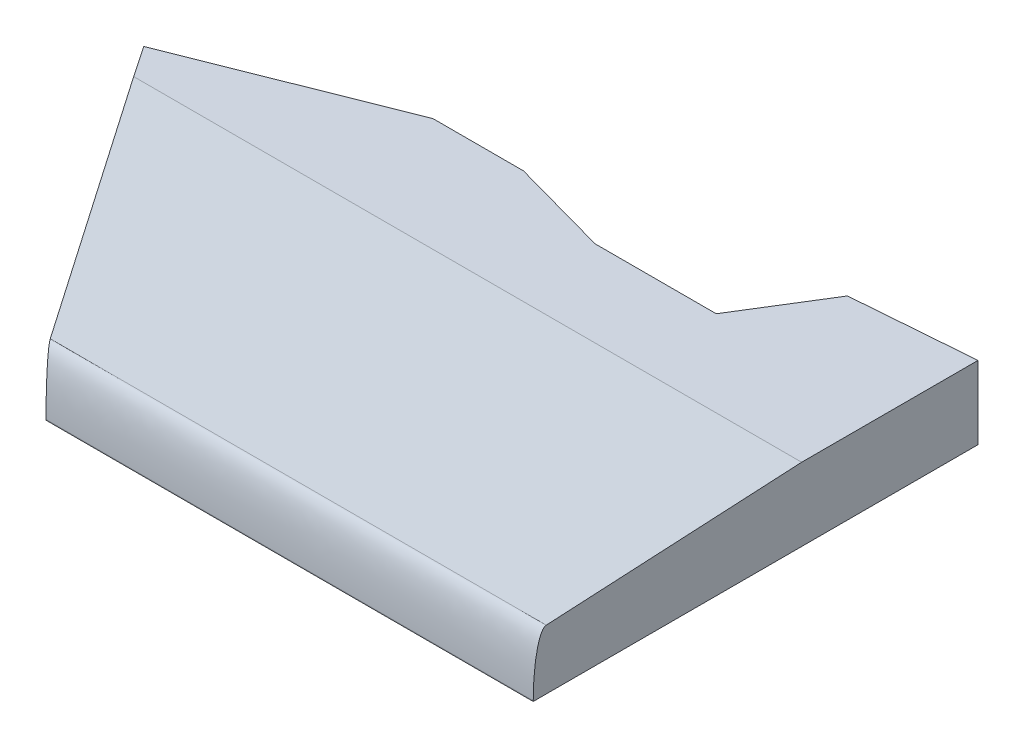
ISO-10303-21;
HEADER;
FILE_DESCRIPTION(('STEP AP214'),'2;1');
FILE_NAME('part.step','',(''),(''),'','','');
FILE_SCHEMA(('AUTOMOTIVE_DESIGN { 1 0 10303 214 1 1 1 1 }'));
ENDSEC;
DATA;
#1=APPLICATION_CONTEXT('core data for automotive mechanical design processes');
#2=APPLICATION_PROTOCOL_DEFINITION('international standard','automotive_design',2000,#1);
#3=PRODUCT_CONTEXT('',#1,'mechanical');
#4=PRODUCT('Part','Part','',(#3));
#5=PRODUCT_RELATED_PRODUCT_CATEGORY('part','',(#4));
#6=PRODUCT_DEFINITION_FORMATION('','',#4);
#7=PRODUCT_DEFINITION_CONTEXT('part definition',#1,'design');
#8=PRODUCT_DEFINITION('design','',#6,#7);
#9=PRODUCT_DEFINITION_SHAPE('','',#8);
#10=(LENGTH_UNIT() NAMED_UNIT(*) SI_UNIT(.MILLI.,.METRE.));
#11=(NAMED_UNIT(*) PLANE_ANGLE_UNIT() SI_UNIT($,.RADIAN.));
#12=(NAMED_UNIT(*) SI_UNIT($,.STERADIAN.) SOLID_ANGLE_UNIT());
#13=UNCERTAINTY_MEASURE_WITH_UNIT(LENGTH_MEASURE(1.E-05),#10,'distance_accuracy_value','');
#14=(GEOMETRIC_REPRESENTATION_CONTEXT(3) GLOBAL_UNCERTAINTY_ASSIGNED_CONTEXT((#13)) GLOBAL_UNIT_ASSIGNED_CONTEXT((#10,
#11,#12)) REPRESENTATION_CONTEXT('',''));
#15=CARTESIAN_POINT('',(0.,0.,0.));
#16=DIRECTION('',(0.,0.,1.));
#17=DIRECTION('',(1.,0.,0.));
#18=AXIS2_PLACEMENT_3D('',#15,#16,#17);
#19=CARTESIAN_POINT('',(6.77357097779002,13.6,17.0708441657719));
#20=DIRECTION('',(-0.36881854007509,0.,-0.929501417157004));
#21=DIRECTION('',(-0.929501417157004,0.,0.36881854007509));
#22=AXIS2_PLACEMENT_3D('',#19,#20,#21);
#23=PLANE('',#22);
#24=DIRECTION('',(0.929501417157004,0.,-0.36881854007509));
#25=VECTOR('',#24,1.);
#26=CARTESIAN_POINT('',(6.77357097779002,0.,17.0708441657719));
#27=LINE('',#26,#25);
#28=CARTESIAN_POINT('',(37.6537953880634,0.,4.8178243489507));
#29=VERTEX_POINT('',#28);
#30=CARTESIAN_POINT('',(76.2078524693681,0.,-10.4801093434911));
#31=VERTEX_POINT('',#30);
#32=EDGE_CURVE('E138',#29,#31,#27,.T.);
#33=ORIENTED_EDGE('',*,*,#32,.F.);
#34=DIRECTION('',(0.,-1.,0.));
#35=VECTOR('',#34,1.);
#36=CARTESIAN_POINT('',(37.6537953880634,13.6,4.8178243489507));
#37=LINE('',#36,#35);
#38=CARTESIAN_POINT('',(37.6537953880634,13.6,4.8178243489507));
#39=VERTEX_POINT('',#38);
#40=EDGE_CURVE('E141',#39,#29,#37,.T.);
#41=ORIENTED_EDGE('',*,*,#40,.F.);
#42=DIRECTION('',(0.929501417157004,0.,-0.36881854007509));
#43=VECTOR('',#42,1.);
#44=CARTESIAN_POINT('',(6.77357097779002,13.6,17.0708441657719));
#45=LINE('',#44,#43);
#46=CARTESIAN_POINT('',(76.2078524693681,13.6,-10.4801093434911));
#47=VERTEX_POINT('',#46);
#48=EDGE_CURVE('E328',#39,#47,#45,.T.);
#49=ORIENTED_EDGE('',*,*,#48,.T.);
#50=DIRECTION('',(0.,-1.,0.));
#51=VECTOR('',#50,1.);
#52=CARTESIAN_POINT('',(76.2078524693681,13.6,-10.4801093434911));
#53=LINE('',#52,#51);
#54=EDGE_CURVE('E143',#47,#31,#53,.T.);
#55=ORIENTED_EDGE('',*,*,#54,.T.);
#56=EDGE_LOOP('',(#33,#41,#49,#55));
#57=FACE_BOUND('',#56,.T.);
#58=ADVANCED_FACE('F48',(#57),#23,.T.);
#59=CARTESIAN_POINT('',(165.988080985326,13.6,0.));
#60=DIRECTION('',(1.,0.,0.));
#61=DIRECTION('',(0.,0.,-1.));
#62=AXIS2_PLACEMENT_3D('',#59,#60,#61);
#63=PLANE('',#62);
#64=DIRECTION('',(0.,0.0523359562429405,-0.998629534754574));
#65=VECTOR('',#64,1.);
#66=CARTESIAN_POINT('',(165.988080985326,14.15494890973,0.0290836399744901));
#67=LINE('',#66,#65);
#68=CARTESIAN_POINT('',(165.988080985326,13.6,10.6181396412382));
#69=VERTEX_POINT('',#68);
#70=CARTESIAN_POINT('',(165.988080985326,11.1066634500202,58.1938351599139));
#71=VERTEX_POINT('',#70);
#72=EDGE_CURVE('E216',#69,#71,#67,.F.);
#73=ORIENTED_EDGE('',*,*,#72,.T.);
#74=CARTESIAN_POINT('',(165.988080985326,0.121738567719923,60.6181396412415));
#75=CARTESIAN_POINT('',(165.988080985326,10.9796110358479,60.6181396412415));
#76=CARTESIAN_POINT('',(165.988080985326,11.1066634500202,58.1938351599139));
#77=(BOUNDED_CURVE() B_SPLINE_CURVE(2,(#74,#75,#76),.UNSPECIFIED.,.F.,
.F.) B_SPLINE_CURVE_WITH_KNOTS((3,3),(0.,1.),
.UNSPECIFIED.) CURVE() GEOMETRIC_REPRESENTATION_ITEM() RATIONAL_B_SPLINE_CURVE((1.,
0.725374371012286,1.)) REPRESENTATION_ITEM(''));
#78=CARTESIAN_POINT('',(165.988080985326,0.121738567719923,60.6181396412415));
#79=VERTEX_POINT('',#78);
#80=EDGE_CURVE('E12',#71,#79,#77,.F.);
#81=ORIENTED_EDGE('',*,*,#80,.T.);
#82=DIRECTION('',(0.,-1.,0.));
#83=VECTOR('',#82,1.);
#84=CARTESIAN_POINT('',(165.988080985326,13.6,60.6181396412415));
#85=LINE('',#84,#83);
#86=CARTESIAN_POINT('',(165.988080985326,0.,60.6181396412415));
#87=VERTEX_POINT('',#86);
#88=EDGE_CURVE('E177',#79,#87,#85,.T.);
#89=ORIENTED_EDGE('',*,*,#88,.T.);
#90=DIRECTION('',(0.,0.,1.));
#91=VECTOR('',#90,1.);
#92=CARTESIAN_POINT('',(165.988080985326,0.,0.));
#93=LINE('',#92,#91);
#94=CARTESIAN_POINT('',(165.988080985326,0.,-22.2356790575523));
#95=VERTEX_POINT('',#94);
#96=EDGE_CURVE('E148',#95,#87,#93,.T.);
#97=ORIENTED_EDGE('',*,*,#96,.F.);
#98=DIRECTION('',(0.,-1.,0.));
#99=VECTOR('',#98,1.);
#100=CARTESIAN_POINT('',(165.988080985326,13.6,-22.2356790575523));
#101=LINE('',#100,#99);
#102=CARTESIAN_POINT('',(165.988080985326,13.6,-22.2356790575523));
#103=VERTEX_POINT('',#102);
#104=EDGE_CURVE('E158',#103,#95,#101,.T.);
#105=ORIENTED_EDGE('',*,*,#104,.F.);
#106=DIRECTION('',(0.,0.,1.));
#107=VECTOR('',#106,1.);
#108=CARTESIAN_POINT('',(165.988080985326,13.6,0.));
#109=LINE('',#108,#107);
#110=EDGE_CURVE('E331',#103,#69,#109,.T.);
#111=ORIENTED_EDGE('',*,*,#110,.T.);
#112=EDGE_LOOP('',(#73,#81,#89,#97,#105,#111));
#113=FACE_BOUND('',#112,.T.);
#114=ADVANCED_FACE('F241',(#113),#63,.T.);
#115=CARTESIAN_POINT('',(-0.719959146505458,13.6,-9.22485841457915));
#116=DIRECTION('',(-0.0778089382117249,0.,-0.99696828893118));
#117=DIRECTION('',(-0.99696828893118,0.,0.0778089382117249));
#118=AXIS2_PLACEMENT_3D('',#115,#116,#117);
#119=PLANE('',#118);
#120=CARTESIAN_POINT('',(154.709225146618,6.8,-21.3554145528569));
#121=DIRECTION('',(-0.0778089382117249,0.,-0.99696828893118));
#122=DIRECTION('',(-0.99696828893118,0.,0.0778089382117249));
#123=AXIS2_PLACEMENT_3D('',#120,#121,#122);
#124=CIRCLE('',#123,1.59999999999999);
#125=CARTESIAN_POINT('',(153.114075884328,6.8,-21.2309202517182));
#126=VERTEX_POINT('',#125);
#127=EDGE_CURVE('E168',#126,#126,#124,.T.);
#128=ORIENTED_EDGE('',*,*,#127,.F.);
#129=EDGE_LOOP('',(#128));
#130=FACE_BOUND('',#129,.T.);
#131=DIRECTION('',(0.99696828893118,0.,-0.0778089382117249));
#132=VECTOR('',#131,1.);
#133=CARTESIAN_POINT('',(-0.719959146505458,0.,-9.22485841457915));
#134=LINE('',#133,#132);
#135=CARTESIAN_POINT('',(143.430369307909,0.,-20.4751500481616));
#136=VERTEX_POINT('',#135);
#137=EDGE_CURVE('E369',#136,#95,#134,.T.);
#138=ORIENTED_EDGE('',*,*,#137,.F.);
#139=DIRECTION('',(0.,-1.,0.));
#140=VECTOR('',#139,1.);
#141=CARTESIAN_POINT('',(143.430369307909,13.6,-20.4751500481616));
#142=LINE('',#141,#140);
#143=CARTESIAN_POINT('',(143.430369307909,13.6,-20.4751500481616));
#144=VERTEX_POINT('',#143);
#145=EDGE_CURVE('E343',#144,#136,#142,.T.);
#146=ORIENTED_EDGE('',*,*,#145,.F.);
#147=DIRECTION('',(0.99696828893118,0.,-0.0778089382117249));
#148=VECTOR('',#147,1.);
#149=CARTESIAN_POINT('',(-0.719959146505458,13.6,-9.22485841457915));
#150=LINE('',#149,#148);
#151=EDGE_CURVE('E354',#144,#103,#150,.T.);
#152=ORIENTED_EDGE('',*,*,#151,.T.);
#153=ORIENTED_EDGE('',*,*,#104,.T.);
#154=EDGE_LOOP('',(#138,#146,#152,#153));
#155=FACE_BOUND('',#154,.T.);
#156=ADVANCED_FACE('F245',(#130,#155),#119,.T.);
#157=CARTESIAN_POINT('',(94.4970010962973,13.6,58.5291646973275));
#158=DIRECTION('',(-0.850140222471449,0.,-0.526556361784943));
#159=DIRECTION('',(-0.526556361784943,0.,0.850140222471449));
#160=AXIS2_PLACEMENT_3D('',#157,#158,#159);
#161=PLANE('',#160);
#162=DIRECTION('',(0.526556361784943,0.,-0.850140222471449));
#163=VECTOR('',#162,1.);
#164=CARTESIAN_POINT('',(94.4970010962973,0.,58.5291646973275));
#165=LINE('',#164,#163);
#166=CARTESIAN_POINT('',(134.081949487101,0.,-5.38186035875846));
#167=VERTEX_POINT('',#166);
#168=EDGE_CURVE('E372',#167,#136,#165,.T.);
#169=ORIENTED_EDGE('',*,*,#168,.F.);
#170=DIRECTION('',(0.,-1.,0.));
#171=VECTOR('',#170,1.);
#172=CARTESIAN_POINT('',(134.081949487101,13.6,-5.38186035875846));
#173=LINE('',#172,#171);
#174=CARTESIAN_POINT('',(134.081949487101,13.6,-5.38186035875846));
#175=VERTEX_POINT('',#174);
#176=EDGE_CURVE('E341',#175,#167,#173,.T.);
#177=ORIENTED_EDGE('',*,*,#176,.F.);
#178=DIRECTION('',(0.526556361784943,0.,-0.850140222471449));
#179=VECTOR('',#178,1.);
#180=CARTESIAN_POINT('',(94.4970010962973,13.6,58.5291646973275));
#181=LINE('',#180,#179);
#182=EDGE_CURVE('E356',#175,#144,#181,.T.);
#183=ORIENTED_EDGE('',*,*,#182,.T.);
#184=ORIENTED_EDGE('',*,*,#145,.T.);
#185=EDGE_LOOP('',(#169,#177,#183,#184));
#186=FACE_BOUND('',#185,.T.);
#187=ADVANCED_FACE('F382',(#186),#161,.T.);
#188=CARTESIAN_POINT('',(0.,13.6,-5.38186035875846));
#189=DIRECTION('',(0.,0.,-1.));
#190=DIRECTION('',(-1.,0.,0.));
#191=AXIS2_PLACEMENT_3D('',#188,#189,#190);
#192=PLANE('',#191);
#193=CARTESIAN_POINT('',(122.796389593283,6.8,-5.38186035875846));
#194=DIRECTION('',(0.,0.,-1.));
#195=DIRECTION('',(-1.,0.,0.));
#196=AXIS2_PLACEMENT_3D('',#193,#194,#195);
#197=CIRCLE('',#196,1.59999999999999);
#198=CARTESIAN_POINT('',(121.196389593283,6.8,-5.38186035875846));
#199=VERTEX_POINT('',#198);
#200=EDGE_CURVE('E304',#199,#199,#197,.T.);
#201=ORIENTED_EDGE('',*,*,#200,.F.);
#202=EDGE_LOOP('',(#201));
#203=FACE_BOUND('',#202,.T.);
#204=DIRECTION('',(1.,0.,0.));
#205=VECTOR('',#204,1.);
#206=CARTESIAN_POINT('',(0.,0.,-5.38186035875846));
#207=LINE('',#206,#205);
#208=CARTESIAN_POINT('',(111.510829699464,0.,-5.38186035875846));
#209=VERTEX_POINT('',#208);
#210=EDGE_CURVE('E332',#209,#167,#207,.T.);
#211=ORIENTED_EDGE('',*,*,#210,.F.);
#212=DIRECTION('',(0.,-1.,0.));
#213=VECTOR('',#212,1.);
#214=CARTESIAN_POINT('',(111.510829699464,13.6,-5.38186035875846));
#215=LINE('',#214,#213);
#216=CARTESIAN_POINT('',(111.510829699464,13.6,-5.38186035875846));
#217=VERTEX_POINT('',#216);
#218=EDGE_CURVE('E339',#217,#209,#215,.T.);
#219=ORIENTED_EDGE('',*,*,#218,.F.);
#220=DIRECTION('',(1.,0.,0.));
#221=VECTOR('',#220,1.);
#222=CARTESIAN_POINT('',(0.,13.6,-5.38186035875846));
#223=LINE('',#222,#221);
#224=EDGE_CURVE('E361',#217,#175,#223,.T.);
#225=ORIENTED_EDGE('',*,*,#224,.T.);
#226=ORIENTED_EDGE('',*,*,#176,.T.);
#227=EDGE_LOOP('',(#211,#219,#225,#226));
#228=FACE_BOUND('',#227,.T.);
#229=ADVANCED_FACE('F378',(#203,#228),#192,.T.);
#230=CARTESIAN_POINT('',(9.29106468024386,13.6,-33.6258870020935));
#231=DIRECTION('',(0.266327421026574,0.,-0.963882619829476));
#232=DIRECTION('',(-0.963882619829476,0.,-0.266327421026574));
#233=AXIS2_PLACEMENT_3D('',#230,#231,#232);
#234=PLANE('',#233);
#235=DIRECTION('',(0.963882619829476,0.,0.266327421026574));
#236=VECTOR('',#235,1.);
#237=CARTESIAN_POINT('',(9.29106468024386,0.,-33.6258870020935));
#238=LINE('',#237,#236);
#239=CARTESIAN_POINT('',(93.0594304067988,0.,-10.4801093434911));
#240=VERTEX_POINT('',#239);
#241=EDGE_CURVE('E329',#240,#209,#238,.T.);
#242=ORIENTED_EDGE('',*,*,#241,.F.);
#243=DIRECTION('',(0.,-1.,0.));
#244=VECTOR('',#243,1.);
#245=CARTESIAN_POINT('',(93.0594304067988,13.6,-10.4801093434911));
#246=LINE('',#245,#244);
#247=CARTESIAN_POINT('',(93.0594304067988,13.6,-10.4801093434911));
#248=VERTEX_POINT('',#247);
#249=EDGE_CURVE('E325',#248,#240,#246,.T.);
#250=ORIENTED_EDGE('',*,*,#249,.F.);
#251=DIRECTION('',(0.963882619829476,0.,0.266327421026574));
#252=VECTOR('',#251,1.);
#253=CARTESIAN_POINT('',(9.29106468024386,13.6,-33.6258870020935));
#254=LINE('',#253,#252);
#255=EDGE_CURVE('E364',#248,#217,#254,.T.);
#256=ORIENTED_EDGE('',*,*,#255,.T.);
#257=ORIENTED_EDGE('',*,*,#218,.T.);
#258=EDGE_LOOP('',(#242,#250,#256,#257));
#259=FACE_BOUND('',#258,.T.);
#260=ADVANCED_FACE('F321',(#259),#234,.T.);
#261=CARTESIAN_POINT('',(0.,13.6,-10.4801093434911));
#262=DIRECTION('',(0.,0.,-1.));
#263=DIRECTION('',(-1.,0.,0.));
#264=AXIS2_PLACEMENT_3D('',#261,#262,#263);
#265=PLANE('',#264);
#266=CARTESIAN_POINT('',(84.6336414380834,6.8,-10.4801093434911));
#267=DIRECTION('',(0.,0.,-1.));
#268=DIRECTION('',(-1.,0.,0.));
#269=AXIS2_PLACEMENT_3D('',#266,#267,#268);
#270=CIRCLE('',#269,1.59999999999999);
#271=CARTESIAN_POINT('',(83.0336414380834,6.8,-10.4801093434911));
#272=VERTEX_POINT('',#271);
#273=EDGE_CURVE('E312',#272,#272,#270,.T.);
#274=ORIENTED_EDGE('',*,*,#273,.F.);
#275=EDGE_LOOP('',(#274));
#276=FACE_BOUND('',#275,.T.);
#277=DIRECTION('',(1.,0.,0.));
#278=VECTOR('',#277,1.);
#279=CARTESIAN_POINT('',(0.,0.,-10.4801093434911));
#280=LINE('',#279,#278);
#281=EDGE_CURVE('E323',#31,#240,#280,.T.);
#282=ORIENTED_EDGE('',*,*,#281,.F.);
#283=ORIENTED_EDGE('',*,*,#54,.F.);
#284=DIRECTION('',(1.,0.,0.));
#285=VECTOR('',#284,1.);
#286=CARTESIAN_POINT('',(0.,13.6,-10.4801093434911));
#287=LINE('',#286,#285);
#288=EDGE_CURVE('E337',#47,#248,#287,.T.);
#289=ORIENTED_EDGE('',*,*,#288,.T.);
#290=ORIENTED_EDGE('',*,*,#249,.T.);
#291=EDGE_LOOP('',(#282,#283,#289,#290));
#292=FACE_BOUND('',#291,.T.);
#293=ADVANCED_FACE('F318',(#276,#292),#265,.T.);
#294=CARTESIAN_POINT('',(0.,13.6,0.));
#295=DIRECTION('',(0.,1.,0.));
#296=DIRECTION('',(0.,0.,1.));
#297=AXIS2_PLACEMENT_3D('',#294,#295,#296);
#298=PLANE('',#297);
#299=DIRECTION('',(-0.558580790911882,0.,-0.829450119069409));
#300=VECTOR('',#299,1.);
#301=CARTESIAN_POINT('',(23.6731707319916,13.6,-15.9423431582645));
#302=LINE('',#301,#300);
#303=CARTESIAN_POINT('',(41.5599310664081,13.6,10.6181396412382));
#304=VERTEX_POINT('',#303);
#305=EDGE_CURVE('E156',#304,#39,#302,.T.);
#306=ORIENTED_EDGE('',*,*,#305,.F.);
#307=DIRECTION('',(1.,0.,0.));
#308=VECTOR('',#307,1.);
#309=CARTESIAN_POINT('',(0.,13.6,10.6181396412383));
#310=LINE('',#309,#308);
#311=EDGE_CURVE('E222',#304,#69,#310,.T.);
#312=ORIENTED_EDGE('',*,*,#311,.T.);
#313=ORIENTED_EDGE('',*,*,#110,.F.);
#314=ORIENTED_EDGE('',*,*,#151,.F.);
#315=ORIENTED_EDGE('',*,*,#182,.F.);
#316=ORIENTED_EDGE('',*,*,#224,.F.);
#317=ORIENTED_EDGE('',*,*,#255,.F.);
#318=ORIENTED_EDGE('',*,*,#288,.F.);
#319=ORIENTED_EDGE('',*,*,#48,.F.);
#320=EDGE_LOOP('',(#306,#312,#313,#314,#315,#316,#317,#318,#319));
#321=FACE_BOUND('',#320,.T.);
#322=ADVANCED_FACE('F210',(#321),#298,.T.);
#323=CARTESIAN_POINT('',(0.,0.,0.));
#324=DIRECTION('',(0.,1.,0.));
#325=DIRECTION('',(0.,0.,1.));
#326=AXIS2_PLACEMENT_3D('',#323,#324,#325);
#327=PLANE('',#326);
#328=ORIENTED_EDGE('',*,*,#32,.T.);
#329=ORIENTED_EDGE('',*,*,#281,.T.);
#330=ORIENTED_EDGE('',*,*,#241,.T.);
#331=ORIENTED_EDGE('',*,*,#210,.T.);
#332=ORIENTED_EDGE('',*,*,#168,.T.);
#333=ORIENTED_EDGE('',*,*,#137,.T.);
#334=ORIENTED_EDGE('',*,*,#96,.T.);
#335=DIRECTION('',(-1.,0.,0.));
#336=VECTOR('',#335,1.);
#337=CARTESIAN_POINT('',(0.,0.,60.6181396412416));
#338=LINE('',#337,#336);
#339=CARTESIAN_POINT('',(75.2316840790311,0.,60.6181396412416));
#340=VERTEX_POINT('',#339);
#341=EDGE_CURVE('E163',#87,#340,#338,.T.);
#342=ORIENTED_EDGE('',*,*,#341,.T.);
#343=DIRECTION('',(-0.558580790911882,0.,-0.829450119069409));
#344=VECTOR('',#343,1.);
#345=CARTESIAN_POINT('',(23.6731707319916,0.,-15.9423431582645));
#346=LINE('',#345,#344);
#347=EDGE_CURVE('E153',#340,#29,#346,.T.);
#348=ORIENTED_EDGE('',*,*,#347,.T.);
#349=EDGE_LOOP('',(#328,#329,#330,#331,#332,#333,#334,#342,#348));
#350=FACE_BOUND('',#349,.T.);
#351=ADVANCED_FACE('F160',(#350),#327,.F.);
#352=CARTESIAN_POINT('',(23.6731707319916,13.6,-15.9423431582645));
#353=DIRECTION('',(-0.829450119069409,0.,0.558580790911882));
#354=DIRECTION('',(0.558580790911882,0.,0.829450119069409));
#355=AXIS2_PLACEMENT_3D('',#352,#353,#354);
#356=PLANE('',#355);
#357=DIRECTION('',(0.,-1.,0.));
#358=VECTOR('',#357,1.);
#359=CARTESIAN_POINT('',(75.2316840790311,13.6,60.6181396412416));
#360=LINE('',#359,#358);
#361=CARTESIAN_POINT('',(75.2316840790311,0.121738567719923,60.6181396412416));
#362=VERTEX_POINT('',#361);
#363=EDGE_CURVE('E149',#362,#340,#360,.T.);
#364=ORIENTED_EDGE('',*,*,#363,.F.);
#365=CARTESIAN_POINT('',(73.599072444578,11.1066634500202,58.1938351599139));
#366=CARTESIAN_POINT('',(73.6062425441456,11.1061062841263,58.2044813686806));
#367=CARTESIAN_POINT('',(73.6134096781486,11.105249884781,58.2151135602919));
#368=CARTESIAN_POINT('',(73.6283188541927,11.1028521469838,58.2372190907396));
#369=CARTESIAN_POINT('',(73.6360587814496,11.1012594581209,58.248688311906));
#370=CARTESIAN_POINT('',(73.6521151519286,11.0972380187822,58.2724778195092));
#371=CARTESIAN_POINT('',(73.6604272066133,11.0947517385886,58.2847913397625));
#372=CARTESIAN_POINT('',(73.6776306582169,11.0887792548417,58.310279388773));
#373=CARTESIAN_POINT('',(73.6865149661012,11.0852287786002,58.3234436381145));
#374=CARTESIAN_POINT('',(73.7048658213362,11.076949457367,58.3506426822312));
#375=CARTESIAN_POINT('',(73.714321936653,11.0721489559919,58.3646626461926));
#376=CARTESIAN_POINT('',(73.7338208398371,11.0611755783679,58.3935836256853));
#377=CARTESIAN_POINT('',(73.7438492322708,11.0549231150962,58.4084642062268));
#378=CARTESIAN_POINT('',(73.7590227755497,11.0445716703148,58.4309888463772));
#379=CARTESIAN_POINT('',(73.7642494723822,11.0408403325584,58.4387494682331));
#380=CARTESIAN_POINT('',(73.7748487349176,11.0329442819212,58.4544905925281));
#381=CARTESIAN_POINT('',(73.7802185839062,11.0287681136354,58.4624671951865));
#382=CARTESIAN_POINT('',(73.7911042211374,11.0199533901288,58.4786403783436));
#383=CARTESIAN_POINT('',(73.7966169251021,11.0153028805723,58.4868325087002));
#384=CARTESIAN_POINT('',(73.8077887115495,11.0055092554563,58.5034372265562));
#385=CARTESIAN_POINT('',(73.8134443350696,11.0003536926875,58.5118447959262));
#386=CARTESIAN_POINT('',(73.824902323072,10.9895187293498,58.5288805940984));
#387=CARTESIAN_POINT('',(73.8307008298659,10.9838264098837,58.5375031941441));
#388=CARTESIAN_POINT('',(73.8424449839322,10.9718856437187,58.5549691157322));
#389=CARTESIAN_POINT('',(73.8483863582034,10.9656238324621,58.5638061649679));
#390=CARTESIAN_POINT('',(73.8604166893002,10.9525106590346,58.5817009523524));
#391=CARTESIAN_POINT('',(73.8665009445967,10.945645515764,58.5907517484365));
#392=CARTESIAN_POINT('',(73.8788173533671,10.9312914697278,58.6090734269724));
#393=CARTESIAN_POINT('',(73.8850443598136,10.9237884195198,58.6183366561674));
#394=CARTESIAN_POINT('',(73.9043705431425,10.8997644606696,58.6470852044819));
#395=CARTESIAN_POINT('',(73.9172500801632,10.882671436773,58.6662427929142));
#396=CARTESIAN_POINT('',(73.9436329507952,10.8456091945741,58.7054643760263));
#397=CARTESIAN_POINT('',(73.9570844554212,10.8255200736582,58.725449301504));
#398=CARTESIAN_POINT('',(73.9800106327997,10.7893851980256,58.7595043576988));
#399=CARTESIAN_POINT('',(73.9896228051593,10.773618781081,58.7737804101675));
#400=CARTESIAN_POINT('',(74.0084191792864,10.7416297924946,58.8017077506643));
#401=CARTESIAN_POINT('',(74.0176067095126,10.7254133917557,58.8153638730788));
#402=CARTESIAN_POINT('',(74.0355561889117,10.6926667240877,58.8420441312777));
#403=CARTESIAN_POINT('',(74.0443221874633,10.6761435593878,58.8550742781101));
#404=CARTESIAN_POINT('',(74.0614268907076,10.6429200168508,58.880498087395));
#405=CARTESIAN_POINT('',(74.0697703317454,10.6262274596854,58.892898812936));
#406=CARTESIAN_POINT('',(74.0938701982262,10.5766792639678,58.9287117926444));
#407=CARTESIAN_POINT('',(74.1092793856095,10.5432754051985,58.9516020983377));
#408=CARTESIAN_POINT('',(74.1383635344896,10.4772618961778,58.9947841279539));
#409=CARTESIAN_POINT('',(74.1520871849357,10.4447213228499,59.0151494979737));
#410=CARTESIAN_POINT('',(74.1777993822369,10.3813368002392,59.0532886616803));
#411=CARTESIAN_POINT('',(74.1898395270976,10.3505605061554,59.0711403411974));
#412=CARTESIAN_POINT('',(74.2121782579137,10.2915135723361,59.1042708967791));
#413=CARTESIAN_POINT('',(74.222529531754,10.2633058854198,59.1196269404455));
#414=CARTESIAN_POINT('',(74.2563912461172,10.1683796350289,59.1698913920261));
#415=CARTESIAN_POINT('',(74.2789799489921,10.1006255418568,59.2034736545992));
#416=CARTESIAN_POINT('',(74.3229492175861,9.96122941923199,59.2688388640079));
#417=CARTESIAN_POINT('',(74.3442741398568,9.88953167479153,59.3005389918575));
#418=CARTESIAN_POINT('',(74.3856865332014,9.74313911883763,59.3620821533768));
#419=CARTESIAN_POINT('',(74.4057395318501,9.66841299486913,59.3918735810571));
#420=CARTESIAN_POINT('',(74.4445916232474,9.51685623482958,59.4495633479881));
#421=CARTESIAN_POINT('',(74.4633732587003,9.44001119669128,59.4774353975109));
#422=CARTESIAN_POINT('',(74.4996683815832,9.28507697640405,59.5312770711804));
#423=CARTESIAN_POINT('',(74.517177640179,9.20698461159353,59.5572403544746));
#424=CARTESIAN_POINT('',(74.5509137712476,9.05037788942969,59.6072746351185));
#425=CARTESIAN_POINT('',(74.5671466704682,8.97186765165385,59.6313545222959));
#426=CARTESIAN_POINT('',(74.6115029087432,8.74903260583798,59.6972129859062));
#427=CARTESIAN_POINT('',(74.6383701933904,8.60392020180228,59.7371782365689));
#428=CARTESIAN_POINT('',(74.6902650061985,8.30595547882953,59.814385402221));
#429=CARTESIAN_POINT('',(74.7151676864021,8.15303426215342,59.8514421648692));
#430=CARTESIAN_POINT('',(74.7630865040952,7.84094709112868,59.9227074852636));
#431=CARTESIAN_POINT('',(74.7860162488409,7.68173843171138,59.9567861698813));
#432=CARTESIAN_POINT('',(74.8299567232441,7.3585703659218,60.0220291440614));
#433=CARTESIAN_POINT('',(74.8509108992166,7.19458616291807,60.0531079431076));
#434=CARTESIAN_POINT('',(74.8908759105204,6.86331040689997,60.1123368061758));
#435=CARTESIAN_POINT('',(74.9098532941444,6.69600588504577,60.1404365665965));
#436=CARTESIAN_POINT('',(74.9458374488251,6.35945763225951,60.1937391149451));
#437=CARTESIAN_POINT('',(74.9628287735656,6.19020867193423,60.2189191846454));
#438=CARTESIAN_POINT('',(74.9936363267823,5.86391675898684,60.264648194323));
#439=CARTESIAN_POINT('',(75.0075953713779,5.70691594745641,60.2854031854415));
#440=CARTESIAN_POINT('',(75.0342596054224,5.38951095833018,60.3250484245414));
#441=CARTESIAN_POINT('',(75.0469358032726,5.22909898025741,60.3438955578134));
#442=CARTESIAN_POINT('',(75.0710200224972,4.90552191747907,60.379693661656));
#443=CARTESIAN_POINT('',(75.082406185496,4.74235160837657,60.3966119736945));
#444=CARTESIAN_POINT('',(75.1039054250421,4.41390623772555,60.4285362007686));
#445=CARTESIAN_POINT('',(75.114002980365,4.248627904795,60.4435188230719));
#446=CARTESIAN_POINT('',(75.1329187556534,3.91660493427585,60.471570289018));
#447=CARTESIAN_POINT('',(75.1417269925479,3.74985847143913,60.4846242054819));
#448=CARTESIAN_POINT('',(75.1580585486824,3.41552083184565,60.5088308129417));
#449=CARTESIAN_POINT('',(75.1655768110328,3.24792886788784,60.5199760212164));
#450=CARTESIAN_POINT('',(75.1790719556702,2.91868687962235,60.5400139912723));
#451=CARTESIAN_POINT('',(75.1850950145121,2.75704282127874,60.5489740211313));
#452=CARTESIAN_POINT('',(75.1960586821038,2.43198106742196,60.5652903889681));
#453=CARTESIAN_POINT('',(75.2009876123918,2.26856211196457,60.5726294210328));
#454=CARTESIAN_POINT('',(75.2097587932229,1.94046329669576,60.5856823088729));
#455=CARTESIAN_POINT('',(75.2135930505516,1.77578274937624,60.5913842120974));
#456=CARTESIAN_POINT('',(75.2201712755323,1.44567744841515,60.6011522220265));
#457=CARTESIAN_POINT('',(75.2229107218703,1.28025240462848,60.6052115461074));
#458=CARTESIAN_POINT('',(75.227296632871,0.949173218768155,60.6116953625163));
#459=CARTESIAN_POINT('',(75.2289418877522,0.783519025366763,60.6141180453553));
#460=CARTESIAN_POINT('',(75.2311334669027,0.452489318392512,60.6173379387458));
#461=CARTESIAN_POINT('',(75.2316817873749,0.287113846810117,60.6181381019971));
#462=CARTESIAN_POINT('',(75.2316840790311,0.121738567719923,60.6181396412416));
#463=B_SPLINE_CURVE_WITH_KNOTS('',3,(#365,#366,#367,#368,#369,#370,#371,#372,#373,#374,#375,
#376,#377,#378,#379,#380,#381,#382,#383,#384,#385,#386,#387,#388,#389,#390,#391,#392,#393,#394,
#395,#396,#397,#398,#399,#400,#401,#402,#403,#404,#405,#406,#407,#408,#409,#410,#411,#412,#413,
#414,#415,#416,#417,#418,#419,#420,#421,#422,#423,#424,#425,#426,#427,#428,#429,#430,#431,#432,
#433,#434,#435,#436,#437,#438,#439,#440,#441,#442,#443,#444,#445,#446,#447,#448,#449,#450,#451,
#452,#453,#454,#455,#456,#457,#458,#459,#460,#461,#462),.UNSPECIFIED.,.F.,.F.,(4,2,2,2,2,2,2,2,
2,2,2,2,2,2,2,2,2,2,2,2,2,2,2,2,2,2,2,2,2,2,2,2,2,2,2,2,2,2,2,2,2,2,2,2,2,2,2,2,4),(0.,
0.0385392328605338,0.0803056709346973,0.125473881133594,0.174269895870109,0.226978390574183,
0.283949256644503,0.314165078589718,0.345610209493004,0.378348966672732,0.412450520031758,
0.447988927971854,0.485043143944084,0.523696993710979,0.564039123851299,0.650157170675988,
0.744208222929242,0.814214199196083,0.883517149712653,0.951892866770031,1.01910315985944,
1.14902625025164,1.27129807847197,1.38396021770359,1.48518078010472,1.72181633138714,
1.96546477738011,2.21412448987755,2.46569951403208,2.71807567005461,2.96917795932157,
3.42772841915247,3.90555862109785,4.39875112225712,4.90333453129025,5.41540554230531,
5.93122595578903,6.40814318397783,6.89415633610423,7.38745484523306,7.88622478923138,
8.38867272868306,8.89304743920525,9.37904681315455,9.8700077479834,10.364466949588,
10.8609475588599,11.3579761882164,11.8540994983251),.UNSPECIFIED.);
#464=CARTESIAN_POINT('',(73.599072444578,11.1066634500202,58.1938351599139));
#465=VERTEX_POINT('',#464);
#466=EDGE_CURVE('E77',#362,#465,#463,.F.);
#467=ORIENTED_EDGE('',*,*,#466,.T.);
#468=DIRECTION('',(0.558053787883856,-0.0434286265590601,0.828667559533782));
#469=VECTOR('',#468,1.);
#470=CARTESIAN_POINT('',(23.7069059777046,14.989350590141,-15.892248876419));
#471=LINE('',#470,#469);
#472=EDGE_CURVE('E157',#465,#304,#471,.F.);
#473=ORIENTED_EDGE('',*,*,#472,.T.);
#474=ORIENTED_EDGE('',*,*,#305,.T.);
#475=ORIENTED_EDGE('',*,*,#40,.T.);
#476=ORIENTED_EDGE('',*,*,#347,.F.);
#477=EDGE_LOOP('',(#364,#467,#473,#474,#475,#476));
#478=FACE_BOUND('',#477,.T.);
#479=ADVANCED_FACE('F152',(#478),#356,.T.);
#480=CARTESIAN_POINT('',(0.,13.6,60.6181396412416));
#481=DIRECTION('',(0.,0.,1.));
#482=DIRECTION('',(1.,0.,0.));
#483=AXIS2_PLACEMENT_3D('',#480,#481,#482);
#484=PLANE('',#483);
#485=ORIENTED_EDGE('',*,*,#88,.F.);
#486=CARTESIAN_POINT('',(68.9796220175406,0.121738567719923,60.6181396412416));
#487=CARTESIAN_POINT('',(102.855591815815,0.121738567719923,60.6181396412416));
#488=CARTESIAN_POINT('',(136.73156161409,0.121738567719923,60.6181396412416));
#489=CARTESIAN_POINT('',(170.607531412364,0.121738567719923,60.6181396412415));
#490=(BOUNDED_CURVE() B_SPLINE_CURVE(3,(#486,#487,#488,#489),.UNSPECIFIED.,.F.,
.F.) B_SPLINE_CURVE_WITH_KNOTS((4,4),(0.0689796220175406,0.170607531412364),
.UNSPECIFIED.) CURVE() GEOMETRIC_REPRESENTATION_ITEM() RATIONAL_B_SPLINE_CURVE((1.,1.,1.,1.)) REPRESENTATION_ITEM(''));
#491=EDGE_CURVE('E188',#79,#362,#490,.F.);
#492=ORIENTED_EDGE('',*,*,#491,.T.);
#493=ORIENTED_EDGE('',*,*,#363,.T.);
#494=ORIENTED_EDGE('',*,*,#341,.F.);
#495=EDGE_LOOP('',(#485,#492,#493,#494));
#496=FACE_BOUND('',#495,.T.);
#497=ADVANCED_FACE('F194',(#496),#484,.T.);
#498=CARTESIAN_POINT('',(0.,10.9796110358479,60.6181396412416));
#499=DIRECTION('',(0.,-0.998629534754574,-0.0523359562429405));
#500=DIRECTION('',(-1.,0.,0.));
#501=AXIS2_PLACEMENT_3D('',#498,#499,#500);
#502=PLANE('',#501);
#503=ORIENTED_EDGE('',*,*,#472,.F.);
#504=CARTESIAN_POINT('',(170.607531412364,11.1066634500202,58.1938351599139));
#505=CARTESIAN_POINT('',(136.731561614089,11.1066634500202,58.1938351599139));
#506=CARTESIAN_POINT('',(102.855591815815,11.1066634500202,58.1938351599139));
#507=CARTESIAN_POINT('',(68.9796220175406,11.1066634500202,58.1938351599139));
#508=(BOUNDED_CURVE() B_SPLINE_CURVE(3,(#504,#505,#506,#507),.UNSPECIFIED.,.F.,
.F.) B_SPLINE_CURVE_WITH_KNOTS((4,4),(0.0689796220175405,0.170607531412364),
.UNSPECIFIED.) CURVE() GEOMETRIC_REPRESENTATION_ITEM() RATIONAL_B_SPLINE_CURVE((1.,1.,1.,1.)) REPRESENTATION_ITEM(''));
#509=EDGE_CURVE('E62',#465,#71,#508,.F.);
#510=ORIENTED_EDGE('',*,*,#509,.T.);
#511=ORIENTED_EDGE('',*,*,#72,.F.);
#512=ORIENTED_EDGE('',*,*,#311,.F.);
#513=EDGE_LOOP('',(#503,#510,#511,#512));
#514=FACE_BOUND('',#513,.T.);
#515=ADVANCED_FACE('F204',(#514),#502,.F.);
#516=CARTESIAN_POINT('',(68.9796220175406,11.1066634500202,58.1938351599139));
#517=CARTESIAN_POINT('',(102.855591815815,11.1066634500202,58.1938351599139));
#518=CARTESIAN_POINT('',(136.731561614089,11.1066634500202,58.1938351599139));
#519=CARTESIAN_POINT('',(170.607531412364,11.1066634500202,58.1938351599139));
#520=CARTESIAN_POINT('',(68.9796220175406,10.9796110358479,60.6181396412416));
#521=CARTESIAN_POINT('',(102.855591815815,10.9796110358479,60.6181396412416));
#522=CARTESIAN_POINT('',(136.731561614089,10.9796110358479,60.6181396412415));
#523=CARTESIAN_POINT('',(170.607531412364,10.9796110358479,60.6181396412415));
#524=CARTESIAN_POINT('',(68.9796220175406,0.121738567719923,60.6181396412416));
#525=CARTESIAN_POINT('',(102.855591815815,0.121738567719923,60.6181396412416));
#526=CARTESIAN_POINT('',(136.73156161409,0.121738567719923,60.6181396412416));
#527=CARTESIAN_POINT('',(170.607531412364,0.121738567719923,60.6181396412415));
#528=(BOUNDED_SURFACE() B_SPLINE_SURFACE(2,3,((#516,#517,#518,#519),(#520,#521,#522,#523),(#524,
#525,#526,#527)),.UNSPECIFIED.,.F.,.F.,.F.) B_SPLINE_SURFACE_WITH_KNOTS((3,3),(4,4),(0.,1.),
(0.0689796220175406,0.170607531412364),
.UNSPECIFIED.) GEOMETRIC_REPRESENTATION_ITEM() RATIONAL_B_SPLINE_SURFACE(((1.,1.,1.,1.),
(0.725374371012287,0.725374371012287,0.725374371012286,0.725374371012286),(1.,1.,1.,1.))) REPRESENTATION_ITEM('') SURFACE());
#529=ORIENTED_EDGE('',*,*,#80,.F.);
#530=ORIENTED_EDGE('',*,*,#509,.F.);
#531=ORIENTED_EDGE('',*,*,#466,.F.);
#532=ORIENTED_EDGE('',*,*,#491,.F.);
#533=EDGE_LOOP('',(#529,#530,#531,#532));
#534=FACE_BOUND('',#533,.T.);
#535=ADVANCED_FACE('F51',(#534),#528,.T.);
#536=CARTESIAN_POINT('',(154.802595872472,6.8,-20.1590526061395));
#537=DIRECTION('',(0.0778089382117249,0.,0.99696828893118));
#538=DIRECTION('',(0.99696828893118,0.,-0.0778089382117249));
#539=AXIS2_PLACEMENT_3D('',#536,#537,#538);
#540=PLANE('',#539);
#541=CARTESIAN_POINT('',(154.802595872472,6.8,-20.1590526061395));
#542=DIRECTION('',(-0.0778089382117249,0.,-0.99696828893118));
#543=DIRECTION('',(-0.99696828893118,0.,0.0778089382117249));
#544=AXIS2_PLACEMENT_3D('',#541,#542,#543);
#545=CIRCLE('',#544,1.59999999999999);
#546=CARTESIAN_POINT('',(153.207446610182,6.8,-20.0345583050008));
#547=VERTEX_POINT('',#546);
#548=EDGE_CURVE('E164',#547,#547,#545,.T.);
#549=ORIENTED_EDGE('',*,*,#548,.T.);
#550=EDGE_LOOP('',(#549));
#551=FACE_BOUND('',#550,.T.);
#552=ADVANCED_FACE('F205',(#551),#540,.F.);
#553=CARTESIAN_POINT('',(154.709225146618,6.8,-21.3554145528569));
#554=DIRECTION('',(-0.0778089382117249,0.,-0.99696828893118));
#555=DIRECTION('',(-0.99696828893118,0.,0.0778089382117249));
#556=AXIS2_PLACEMENT_3D('',#553,#554,#555);
#557=CYLINDRICAL_SURFACE('',#556,1.59999999999999);
#558=ORIENTED_EDGE('',*,*,#548,.F.);
#559=EDGE_LOOP('',(#558));
#560=FACE_BOUND('',#559,.T.);
#561=ORIENTED_EDGE('',*,*,#127,.T.);
#562=EDGE_LOOP('',(#561));
#563=FACE_BOUND('',#562,.T.);
#564=ADVANCED_FACE('F289',(#560,#563),#557,.F.);
#565=CARTESIAN_POINT('',(122.796389593283,6.8,-4.18186035875846));
#566=DIRECTION('',(0.,0.,1.));
#567=DIRECTION('',(1.,0.,0.));
#568=AXIS2_PLACEMENT_3D('',#565,#566,#567);
#569=PLANE('',#568);
#570=CARTESIAN_POINT('',(122.796389593283,6.8,-4.18186035875847));
#571=DIRECTION('',(0.,0.,-1.));
#572=DIRECTION('',(-1.,0.,0.));
#573=AXIS2_PLACEMENT_3D('',#570,#571,#572);
#574=CIRCLE('',#573,1.59999999999999);
#575=CARTESIAN_POINT('',(121.196389593283,6.8,-4.18186035875847));
#576=VERTEX_POINT('',#575);
#577=EDGE_CURVE('E301',#576,#576,#574,.T.);
#578=ORIENTED_EDGE('',*,*,#577,.T.);
#579=EDGE_LOOP('',(#578));
#580=FACE_BOUND('',#579,.T.);
#581=ADVANCED_FACE('F294',(#580),#569,.F.);
#582=CARTESIAN_POINT('',(122.796389593283,6.8,-5.38186035875846));
#583=DIRECTION('',(0.,0.,-1.));
#584=DIRECTION('',(-1.,0.,0.));
#585=AXIS2_PLACEMENT_3D('',#582,#583,#584);
#586=CYLINDRICAL_SURFACE('',#585,1.59999999999999);
#587=ORIENTED_EDGE('',*,*,#577,.F.);
#588=EDGE_LOOP('',(#587));
#589=FACE_BOUND('',#588,.T.);
#590=ORIENTED_EDGE('',*,*,#200,.T.);
#591=EDGE_LOOP('',(#590));
#592=FACE_BOUND('',#591,.T.);
#593=ADVANCED_FACE('F489',(#589,#592),#586,.F.);
#594=CARTESIAN_POINT('',(84.6336414380834,6.8,-9.28010934349106));
#595=DIRECTION('',(0.,0.,1.));
#596=DIRECTION('',(1.,0.,0.));
#597=AXIS2_PLACEMENT_3D('',#594,#595,#596);
#598=PLANE('',#597);
#599=CARTESIAN_POINT('',(84.6336414380834,6.8,-9.28010934349107));
#600=DIRECTION('',(0.,0.,-1.));
#601=DIRECTION('',(-1.,0.,0.));
#602=AXIS2_PLACEMENT_3D('',#599,#600,#601);
#603=CIRCLE('',#602,1.59999999999999);
#604=CARTESIAN_POINT('',(83.0336414380834,6.8,-9.28010934349107));
#605=VERTEX_POINT('',#604);
#606=EDGE_CURVE('E309',#605,#605,#603,.T.);
#607=ORIENTED_EDGE('',*,*,#606,.T.);
#608=EDGE_LOOP('',(#607));
#609=FACE_BOUND('',#608,.T.);
#610=ADVANCED_FACE('F498',(#609),#598,.F.);
#611=CARTESIAN_POINT('',(84.6336414380834,6.8,-10.4801093434911));
#612=DIRECTION('',(0.,0.,-1.));
#613=DIRECTION('',(-1.,0.,0.));
#614=AXIS2_PLACEMENT_3D('',#611,#612,#613);
#615=CYLINDRICAL_SURFACE('',#614,1.59999999999999);
#616=ORIENTED_EDGE('',*,*,#606,.F.);
#617=EDGE_LOOP('',(#616));
#618=FACE_BOUND('',#617,.T.);
#619=ORIENTED_EDGE('',*,*,#273,.T.);
#620=EDGE_LOOP('',(#619));
#621=FACE_BOUND('',#620,.T.);
#622=ADVANCED_FACE('F316',(#618,#621),#615,.F.);
#623=CLOSED_SHELL('',(#58,#114,#156,#187,#229,#260,#293,#322,#351,#479,#497,#515,#535,#552,#564,
#581,#593,#610,#622));
#624=MANIFOLD_SOLID_BREP('B2',#623);
#625=ADVANCED_BREP_SHAPE_REPRESENTATION('',(#18,#624),#14);
#626=SHAPE_DEFINITION_REPRESENTATION(#9,#625);
ENDSEC;
END-ISO-10303-21;
